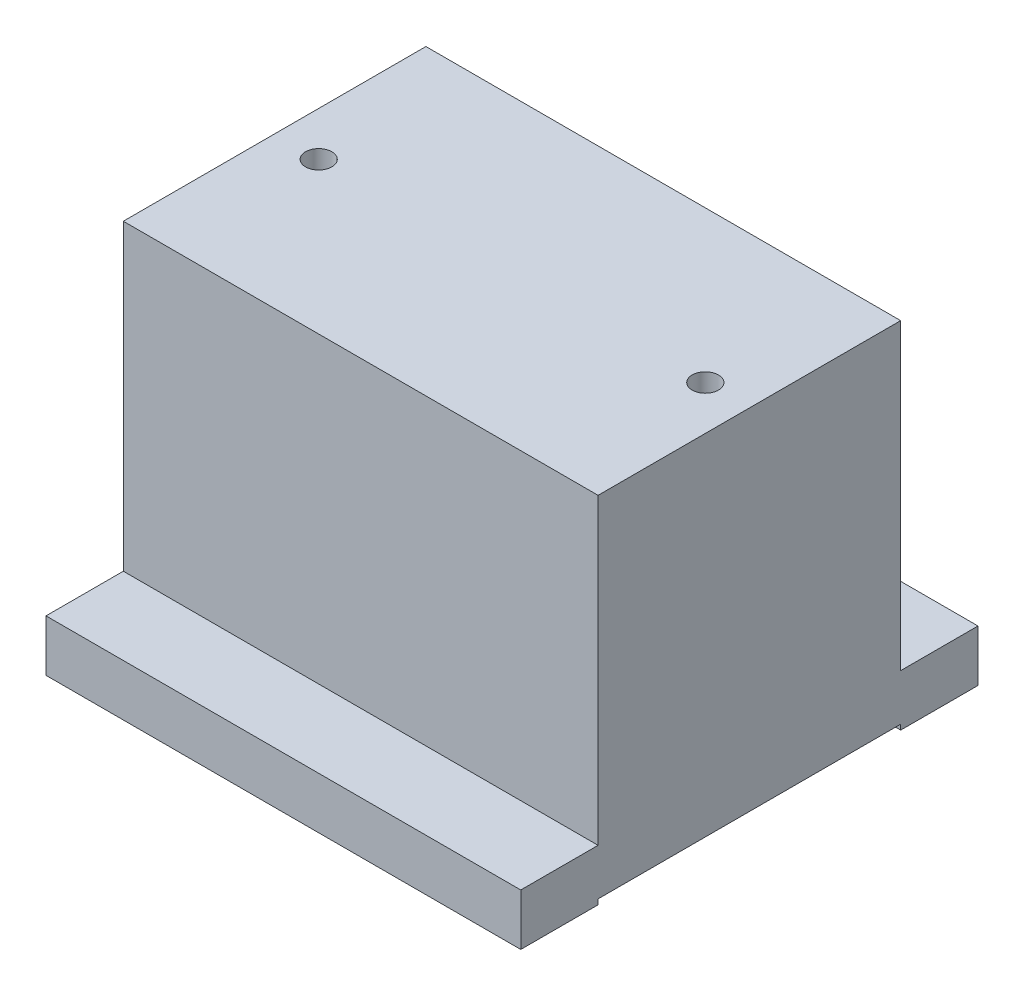
ISO-10303-21;
HEADER;
FILE_DESCRIPTION(('STEP AP214'),'2;1');
FILE_NAME('part.step','',(''),(''),'','','');
FILE_SCHEMA(('AUTOMOTIVE_DESIGN { 1 0 10303 214 1 1 1 1 }'));
ENDSEC;
DATA;
#1=APPLICATION_CONTEXT('core data for automotive mechanical design processes');
#2=APPLICATION_PROTOCOL_DEFINITION('international standard','automotive_design',2000,#1);
#3=PRODUCT_CONTEXT('',#1,'mechanical');
#4=PRODUCT('Part','Part','',(#3));
#5=PRODUCT_RELATED_PRODUCT_CATEGORY('part','',(#4));
#6=PRODUCT_DEFINITION_FORMATION('','',#4);
#7=PRODUCT_DEFINITION_CONTEXT('part definition',#1,'design');
#8=PRODUCT_DEFINITION('design','',#6,#7);
#9=PRODUCT_DEFINITION_SHAPE('','',#8);
#10=(LENGTH_UNIT() NAMED_UNIT(*) SI_UNIT(.MILLI.,.METRE.));
#11=(NAMED_UNIT(*) PLANE_ANGLE_UNIT() SI_UNIT($,.RADIAN.));
#12=(NAMED_UNIT(*) SI_UNIT($,.STERADIAN.) SOLID_ANGLE_UNIT());
#13=UNCERTAINTY_MEASURE_WITH_UNIT(LENGTH_MEASURE(1.E-05),#10,'distance_accuracy_value','');
#14=(GEOMETRIC_REPRESENTATION_CONTEXT(3) GLOBAL_UNCERTAINTY_ASSIGNED_CONTEXT((#13)) GLOBAL_UNIT_ASSIGNED_CONTEXT((#10,
#11,#12)) REPRESENTATION_CONTEXT('',''));
#15=CARTESIAN_POINT('',(0.,0.,0.));
#16=DIRECTION('',(0.,0.,1.));
#17=DIRECTION('',(1.,0.,0.));
#18=AXIS2_PLACEMENT_3D('',#15,#16,#17);
#19=CARTESIAN_POINT('',(46.05,0.,44.35));
#20=DIRECTION('',(0.,1.,0.));
#21=DIRECTION('',(0.,0.,1.));
#22=AXIS2_PLACEMENT_3D('',#19,#20,#21);
#23=PLANE('',#22);
#24=DIRECTION('',(0.,0.,-1.));
#25=VECTOR('',#24,1.);
#26=CARTESIAN_POINT('',(46.05,0.,-44.35));
#27=LINE('',#26,#25);
#28=CARTESIAN_POINT('',(46.05,0.,-29.35));
#29=VERTEX_POINT('',#28);
#30=CARTESIAN_POINT('',(46.05,0.,-44.35));
#31=VERTEX_POINT('',#30);
#32=EDGE_CURVE('E207',#29,#31,#27,.T.);
#33=ORIENTED_EDGE('',*,*,#32,.F.);
#34=DIRECTION('',(1.,0.,0.));
#35=VECTOR('',#34,1.);
#36=CARTESIAN_POINT('',(-46.05,0.,-29.35));
#37=LINE('',#36,#35);
#38=CARTESIAN_POINT('',(-46.05,0.,-29.35));
#39=VERTEX_POINT('',#38);
#40=EDGE_CURVE('E157',#39,#29,#37,.T.);
#41=ORIENTED_EDGE('',*,*,#40,.F.);
#42=DIRECTION('',(0.,0.,1.));
#43=VECTOR('',#42,1.);
#44=CARTESIAN_POINT('',(-46.05,0.,-44.35));
#45=LINE('',#44,#43);
#46=CARTESIAN_POINT('',(-46.05,0.,-44.35));
#47=VERTEX_POINT('',#46);
#48=EDGE_CURVE('E253',#47,#39,#45,.T.);
#49=ORIENTED_EDGE('',*,*,#48,.F.);
#50=DIRECTION('',(-1.,0.,0.));
#51=VECTOR('',#50,1.);
#52=CARTESIAN_POINT('',(-46.05,0.,-44.35));
#53=LINE('',#52,#51);
#54=EDGE_CURVE('E256',#31,#47,#53,.T.);
#55=ORIENTED_EDGE('',*,*,#54,.F.);
#56=EDGE_LOOP('',(#33,#41,#49,#55));
#57=FACE_BOUND('',#56,.T.);
#58=ADVANCED_FACE('F36',(#57),#23,.F.);
#59=CARTESIAN_POINT('',(46.05,10.,44.35));
#60=DIRECTION('',(0.,1.,0.));
#61=DIRECTION('',(0.,0.,1.));
#62=AXIS2_PLACEMENT_3D('',#59,#60,#61);
#63=PLANE('',#62);
#64=DIRECTION('',(1.,0.,0.));
#65=VECTOR('',#64,1.);
#66=CARTESIAN_POINT('',(-46.05,10.,29.35));
#67=LINE('',#66,#65);
#68=CARTESIAN_POINT('',(-46.05,10.,29.35));
#69=VERTEX_POINT('',#68);
#70=CARTESIAN_POINT('',(46.05,10.,29.35));
#71=VERTEX_POINT('',#70);
#72=EDGE_CURVE('E61',#69,#71,#67,.T.);
#73=ORIENTED_EDGE('',*,*,#72,.F.);
#74=DIRECTION('',(0.,0.,1.));
#75=VECTOR('',#74,1.);
#76=CARTESIAN_POINT('',(-46.05,10.,-44.35));
#77=LINE('',#76,#75);
#78=CARTESIAN_POINT('',(-46.05,10.,44.35));
#79=VERTEX_POINT('',#78);
#80=EDGE_CURVE('E195',#69,#79,#77,.T.);
#81=ORIENTED_EDGE('',*,*,#80,.T.);
#82=DIRECTION('',(1.,0.,0.));
#83=VECTOR('',#82,1.);
#84=CARTESIAN_POINT('',(-46.05,10.,44.35));
#85=LINE('',#84,#83);
#86=CARTESIAN_POINT('',(46.05,10.,44.35));
#87=VERTEX_POINT('',#86);
#88=EDGE_CURVE('E230',#79,#87,#85,.T.);
#89=ORIENTED_EDGE('',*,*,#88,.T.);
#90=DIRECTION('',(0.,0.,-1.));
#91=VECTOR('',#90,1.);
#92=CARTESIAN_POINT('',(46.05,10.,-44.35));
#93=LINE('',#92,#91);
#94=EDGE_CURVE('E231',#87,#71,#93,.T.);
#95=ORIENTED_EDGE('',*,*,#94,.T.);
#96=EDGE_LOOP('',(#73,#81,#89,#95));
#97=FACE_BOUND('',#96,.T.);
#98=ADVANCED_FACE('F297',(#97),#63,.T.);
#99=CARTESIAN_POINT('',(46.05,10.,-44.35));
#100=DIRECTION('',(-1.,0.,0.));
#101=DIRECTION('',(0.,0.,1.));
#102=AXIS2_PLACEMENT_3D('',#99,#100,#101);
#103=PLANE('',#102);
#104=DIRECTION('',(0.,0.,1.));
#105=VECTOR('',#104,1.);
#106=CARTESIAN_POINT('',(46.05,1.,29.35));
#107=LINE('',#106,#105);
#108=CARTESIAN_POINT('',(46.05,1.,-29.35));
#109=VERTEX_POINT('',#108);
#110=CARTESIAN_POINT('',(46.05,1.,29.35));
#111=VERTEX_POINT('',#110);
#112=EDGE_CURVE('E153',#109,#111,#107,.T.);
#113=ORIENTED_EDGE('',*,*,#112,.F.);
#114=DIRECTION('',(0.,-1.,0.));
#115=VECTOR('',#114,1.);
#116=CARTESIAN_POINT('',(46.05,1.,-29.35));
#117=LINE('',#116,#115);
#118=EDGE_CURVE('E167',#109,#29,#117,.T.);
#119=ORIENTED_EDGE('',*,*,#118,.T.);
#120=ORIENTED_EDGE('',*,*,#32,.T.);
#121=DIRECTION('',(0.,-1.,0.));
#122=VECTOR('',#121,1.);
#123=CARTESIAN_POINT('',(46.05,10.,-44.35));
#124=LINE('',#123,#122);
#125=CARTESIAN_POINT('',(46.05,10.,-44.35));
#126=VERTEX_POINT('',#125);
#127=EDGE_CURVE('E11',#126,#31,#124,.T.);
#128=ORIENTED_EDGE('',*,*,#127,.F.);
#129=CARTESIAN_POINT('',(46.05,10.,-29.35));
#130=VERTEX_POINT('',#129);
#131=EDGE_CURVE('E236',#130,#126,#93,.T.);
#132=ORIENTED_EDGE('',*,*,#131,.F.);
#133=DIRECTION('',(0.,-1.,0.));
#134=VECTOR('',#133,1.);
#135=CARTESIAN_POINT('',(46.05,68.8,-29.35));
#136=LINE('',#135,#134);
#137=CARTESIAN_POINT('',(46.05,68.8,-29.35));
#138=VERTEX_POINT('',#137);
#139=EDGE_CURVE('E201',#138,#130,#136,.T.);
#140=ORIENTED_EDGE('',*,*,#139,.F.);
#141=DIRECTION('',(0.,0.,-1.));
#142=VECTOR('',#141,1.);
#143=CARTESIAN_POINT('',(46.05,68.8,-29.35));
#144=LINE('',#143,#142);
#145=CARTESIAN_POINT('',(46.05,68.8,29.35));
#146=VERTEX_POINT('',#145);
#147=EDGE_CURVE('E177',#146,#138,#144,.T.);
#148=ORIENTED_EDGE('',*,*,#147,.F.);
#149=DIRECTION('',(0.,-1.,0.));
#150=VECTOR('',#149,1.);
#151=CARTESIAN_POINT('',(46.05,68.8,29.35));
#152=LINE('',#151,#150);
#153=EDGE_CURVE('E186',#146,#71,#152,.T.);
#154=ORIENTED_EDGE('',*,*,#153,.T.);
#155=ORIENTED_EDGE('',*,*,#94,.F.);
#156=DIRECTION('',(0.,-1.,0.));
#157=VECTOR('',#156,1.);
#158=CARTESIAN_POINT('',(46.05,10.,44.35));
#159=LINE('',#158,#157);
#160=CARTESIAN_POINT('',(46.05,0.,44.35));
#161=VERTEX_POINT('',#160);
#162=EDGE_CURVE('E249',#87,#161,#159,.T.);
#163=ORIENTED_EDGE('',*,*,#162,.T.);
#164=CARTESIAN_POINT('',(46.05,0.,29.35));
#165=VERTEX_POINT('',#164);
#166=EDGE_CURVE('E257',#161,#165,#27,.T.);
#167=ORIENTED_EDGE('',*,*,#166,.T.);
#168=DIRECTION('',(0.,-1.,0.));
#169=VECTOR('',#168,1.);
#170=CARTESIAN_POINT('',(46.05,1.,29.35));
#171=LINE('',#170,#169);
#172=EDGE_CURVE('E53',#111,#165,#171,.T.);
#173=ORIENTED_EDGE('',*,*,#172,.F.);
#174=EDGE_LOOP('',(#113,#119,#120,#128,#132,#140,#148,#154,#155,#163,#167,#173));
#175=FACE_BOUND('',#174,.T.);
#176=ADVANCED_FACE('F38',(#175),#103,.F.);
#177=CARTESIAN_POINT('',(-46.05,10.,-44.35));
#178=DIRECTION('',(0.,0.,1.));
#179=DIRECTION('',(1.,0.,0.));
#180=AXIS2_PLACEMENT_3D('',#177,#178,#179);
#181=PLANE('',#180);
#182=ORIENTED_EDGE('',*,*,#54,.T.);
#183=DIRECTION('',(0.,-1.,0.));
#184=VECTOR('',#183,1.);
#185=CARTESIAN_POINT('',(-46.05,10.,-44.35));
#186=LINE('',#185,#184);
#187=CARTESIAN_POINT('',(-46.05,10.,-44.35));
#188=VERTEX_POINT('',#187);
#189=EDGE_CURVE('E45',#188,#47,#186,.T.);
#190=ORIENTED_EDGE('',*,*,#189,.F.);
#191=DIRECTION('',(-1.,0.,0.));
#192=VECTOR('',#191,1.);
#193=CARTESIAN_POINT('',(-46.05,10.,-44.35));
#194=LINE('',#193,#192);
#195=EDGE_CURVE('E229',#126,#188,#194,.T.);
#196=ORIENTED_EDGE('',*,*,#195,.F.);
#197=ORIENTED_EDGE('',*,*,#127,.T.);
#198=EDGE_LOOP('',(#182,#190,#196,#197));
#199=FACE_BOUND('',#198,.T.);
#200=ADVANCED_FACE('F270',(#199),#181,.F.);
#201=CARTESIAN_POINT('',(-46.05,10.,-44.35));
#202=DIRECTION('',(1.,0.,0.));
#203=DIRECTION('',(0.,0.,-1.));
#204=AXIS2_PLACEMENT_3D('',#201,#202,#203);
#205=PLANE('',#204);
#206=ORIENTED_EDGE('',*,*,#48,.T.);
#207=DIRECTION('',(0.,-1.,0.));
#208=VECTOR('',#207,1.);
#209=CARTESIAN_POINT('',(-46.05,1.,-29.35));
#210=LINE('',#209,#208);
#211=CARTESIAN_POINT('',(-46.05,1.,-29.35));
#212=VERTEX_POINT('',#211);
#213=EDGE_CURVE('E171',#212,#39,#210,.T.);
#214=ORIENTED_EDGE('',*,*,#213,.F.);
#215=DIRECTION('',(0.,0.,-1.));
#216=VECTOR('',#215,1.);
#217=CARTESIAN_POINT('',(-46.05,1.,29.35));
#218=LINE('',#217,#216);
#219=CARTESIAN_POINT('',(-46.05,1.,29.35));
#220=VERTEX_POINT('',#219);
#221=EDGE_CURVE('E160',#220,#212,#218,.T.);
#222=ORIENTED_EDGE('',*,*,#221,.F.);
#223=DIRECTION('',(0.,-1.,0.));
#224=VECTOR('',#223,1.);
#225=CARTESIAN_POINT('',(-46.05,1.,29.35));
#226=LINE('',#225,#224);
#227=CARTESIAN_POINT('',(-46.05,0.,29.35));
#228=VERTEX_POINT('',#227);
#229=EDGE_CURVE('E173',#220,#228,#226,.T.);
#230=ORIENTED_EDGE('',*,*,#229,.T.);
#231=CARTESIAN_POINT('',(-46.05,0.,44.35));
#232=VERTEX_POINT('',#231);
#233=EDGE_CURVE('E255',#228,#232,#45,.T.);
#234=ORIENTED_EDGE('',*,*,#233,.T.);
#235=DIRECTION('',(0.,-1.,0.));
#236=VECTOR('',#235,1.);
#237=CARTESIAN_POINT('',(-46.05,10.,44.35));
#238=LINE('',#237,#236);
#239=EDGE_CURVE('E226',#79,#232,#238,.T.);
#240=ORIENTED_EDGE('',*,*,#239,.F.);
#241=ORIENTED_EDGE('',*,*,#80,.F.);
#242=DIRECTION('',(0.,-1.,0.));
#243=VECTOR('',#242,1.);
#244=CARTESIAN_POINT('',(-46.05,68.8,29.35));
#245=LINE('',#244,#243);
#246=CARTESIAN_POINT('',(-46.05,68.8,29.35));
#247=VERTEX_POINT('',#246);
#248=EDGE_CURVE('E202',#247,#69,#245,.T.);
#249=ORIENTED_EDGE('',*,*,#248,.F.);
#250=DIRECTION('',(0.,0.,1.));
#251=VECTOR('',#250,1.);
#252=CARTESIAN_POINT('',(-46.05,68.8,-29.35));
#253=LINE('',#252,#251);
#254=CARTESIAN_POINT('',(-46.05,68.8,-29.35));
#255=VERTEX_POINT('',#254);
#256=EDGE_CURVE('E182',#255,#247,#253,.T.);
#257=ORIENTED_EDGE('',*,*,#256,.F.);
#258=DIRECTION('',(0.,-1.,0.));
#259=VECTOR('',#258,1.);
#260=CARTESIAN_POINT('',(-46.05,68.8,-29.35));
#261=LINE('',#260,#259);
#262=CARTESIAN_POINT('',(-46.05,10.,-29.35));
#263=VERTEX_POINT('',#262);
#264=EDGE_CURVE('E198',#255,#263,#261,.T.);
#265=ORIENTED_EDGE('',*,*,#264,.T.);
#266=EDGE_CURVE('E228',#188,#263,#77,.T.);
#267=ORIENTED_EDGE('',*,*,#266,.F.);
#268=ORIENTED_EDGE('',*,*,#189,.T.);
#269=EDGE_LOOP('',(#206,#214,#222,#230,#234,#240,#241,#249,#257,#265,#267,#268));
#270=FACE_BOUND('',#269,.T.);
#271=ADVANCED_FACE('F223',(#270),#205,.F.);
#272=CARTESIAN_POINT('',(-46.05,10.,44.35));
#273=DIRECTION('',(0.,0.,-1.));
#274=DIRECTION('',(-1.,0.,0.));
#275=AXIS2_PLACEMENT_3D('',#272,#273,#274);
#276=PLANE('',#275);
#277=DIRECTION('',(1.,0.,0.));
#278=VECTOR('',#277,1.);
#279=CARTESIAN_POINT('',(-46.05,0.,44.35));
#280=LINE('',#279,#278);
#281=EDGE_CURVE('E244',#232,#161,#280,.T.);
#282=ORIENTED_EDGE('',*,*,#281,.T.);
#283=ORIENTED_EDGE('',*,*,#162,.F.);
#284=ORIENTED_EDGE('',*,*,#88,.F.);
#285=ORIENTED_EDGE('',*,*,#239,.T.);
#286=EDGE_LOOP('',(#282,#283,#284,#285));
#287=FACE_BOUND('',#286,.T.);
#288=ADVANCED_FACE('F312',(#287),#276,.F.);
#289=DIRECTION('',(-1.,0.,0.));
#290=VECTOR('',#289,1.);
#291=CARTESIAN_POINT('',(-46.05,10.,-29.35));
#292=LINE('',#291,#290);
#293=EDGE_CURVE('E170',#130,#263,#292,.T.);
#294=ORIENTED_EDGE('',*,*,#293,.F.);
#295=ORIENTED_EDGE('',*,*,#131,.T.);
#296=ORIENTED_EDGE('',*,*,#195,.T.);
#297=ORIENTED_EDGE('',*,*,#266,.T.);
#298=EDGE_LOOP('',(#294,#295,#296,#297));
#299=FACE_BOUND('',#298,.T.);
#300=ADVANCED_FACE('F273',(#299),#63,.T.);
#301=ORIENTED_EDGE('',*,*,#233,.F.);
#302=DIRECTION('',(-1.,0.,0.));
#303=VECTOR('',#302,1.);
#304=CARTESIAN_POINT('',(-46.05,0.,29.35));
#305=LINE('',#304,#303);
#306=EDGE_CURVE('E152',#165,#228,#305,.T.);
#307=ORIENTED_EDGE('',*,*,#306,.F.);
#308=ORIENTED_EDGE('',*,*,#166,.F.);
#309=ORIENTED_EDGE('',*,*,#281,.F.);
#310=EDGE_LOOP('',(#301,#307,#308,#309));
#311=FACE_BOUND('',#310,.T.);
#312=ADVANCED_FACE('F299',(#311),#23,.F.);
#313=CARTESIAN_POINT('',(-46.05,68.8,-29.35));
#314=DIRECTION('',(0.,0.,1.));
#315=DIRECTION('',(1.,0.,0.));
#316=AXIS2_PLACEMENT_3D('',#313,#314,#315);
#317=PLANE('',#316);
#318=ORIENTED_EDGE('',*,*,#293,.T.);
#319=ORIENTED_EDGE('',*,*,#264,.F.);
#320=DIRECTION('',(-1.,0.,0.));
#321=VECTOR('',#320,1.);
#322=CARTESIAN_POINT('',(-46.05,68.8,-29.35));
#323=LINE('',#322,#321);
#324=EDGE_CURVE('E180',#138,#255,#323,.T.);
#325=ORIENTED_EDGE('',*,*,#324,.F.);
#326=ORIENTED_EDGE('',*,*,#139,.T.);
#327=EDGE_LOOP('',(#318,#319,#325,#326));
#328=FACE_BOUND('',#327,.T.);
#329=ADVANCED_FACE('F275',(#328),#317,.F.);
#330=CARTESIAN_POINT('',(-46.05,68.8,29.35));
#331=DIRECTION('',(0.,0.,-1.));
#332=DIRECTION('',(-1.,0.,0.));
#333=AXIS2_PLACEMENT_3D('',#330,#331,#332);
#334=PLANE('',#333);
#335=ORIENTED_EDGE('',*,*,#72,.T.);
#336=ORIENTED_EDGE('',*,*,#153,.F.);
#337=DIRECTION('',(1.,0.,0.));
#338=VECTOR('',#337,1.);
#339=CARTESIAN_POINT('',(-46.05,68.8,29.35));
#340=LINE('',#339,#338);
#341=EDGE_CURVE('E184',#247,#146,#340,.T.);
#342=ORIENTED_EDGE('',*,*,#341,.F.);
#343=ORIENTED_EDGE('',*,*,#248,.T.);
#344=EDGE_LOOP('',(#335,#336,#342,#343));
#345=FACE_BOUND('',#344,.T.);
#346=ADVANCED_FACE('F218',(#345),#334,.F.);
#347=CARTESIAN_POINT('',(46.05,68.8,29.35));
#348=DIRECTION('',(0.,1.,0.));
#349=DIRECTION('',(0.,0.,1.));
#350=AXIS2_PLACEMENT_3D('',#347,#348,#349);
#351=PLANE('',#350);
#352=CARTESIAN_POINT('',(-37.5,68.8,0.));
#353=DIRECTION('',(0.,1.,0.));
#354=DIRECTION('',(0.,0.,1.));
#355=AXIS2_PLACEMENT_3D('',#352,#353,#354);
#356=CIRCLE('',#355,2.55269999999999);
#357=CARTESIAN_POINT('',(-37.5,68.8,2.55269999999999));
#358=VERTEX_POINT('',#357);
#359=EDGE_CURVE('E142',#358,#358,#356,.T.);
#360=ORIENTED_EDGE('',*,*,#359,.F.);
#361=EDGE_LOOP('',(#360));
#362=FACE_BOUND('',#361,.T.);
#363=CARTESIAN_POINT('',(37.5,68.8,0.));
#364=DIRECTION('',(0.,1.,0.));
#365=DIRECTION('',(0.,0.,1.));
#366=AXIS2_PLACEMENT_3D('',#363,#364,#365);
#367=CIRCLE('',#366,2.55269999999999);
#368=CARTESIAN_POINT('',(37.5,68.8,2.55269999999999));
#369=VERTEX_POINT('',#368);
#370=EDGE_CURVE('E141',#369,#369,#367,.T.);
#371=ORIENTED_EDGE('',*,*,#370,.F.);
#372=EDGE_LOOP('',(#371));
#373=FACE_BOUND('',#372,.T.);
#374=ORIENTED_EDGE('',*,*,#147,.T.);
#375=ORIENTED_EDGE('',*,*,#324,.T.);
#376=ORIENTED_EDGE('',*,*,#256,.T.);
#377=ORIENTED_EDGE('',*,*,#341,.T.);
#378=EDGE_LOOP('',(#374,#375,#376,#377));
#379=FACE_BOUND('',#378,.T.);
#380=ADVANCED_FACE('F280',(#362,#373,#379),#351,.T.);
#381=CARTESIAN_POINT('',(-46.05,1.,-29.35));
#382=DIRECTION('',(0.,0.,-1.));
#383=DIRECTION('',(-1.,0.,0.));
#384=AXIS2_PLACEMENT_3D('',#381,#382,#383);
#385=PLANE('',#384);
#386=ORIENTED_EDGE('',*,*,#40,.T.);
#387=ORIENTED_EDGE('',*,*,#118,.F.);
#388=DIRECTION('',(1.,0.,0.));
#389=VECTOR('',#388,1.);
#390=CARTESIAN_POINT('',(-46.05,1.,-29.35));
#391=LINE('',#390,#389);
#392=EDGE_CURVE('E162',#212,#109,#391,.T.);
#393=ORIENTED_EDGE('',*,*,#392,.F.);
#394=ORIENTED_EDGE('',*,*,#213,.T.);
#395=EDGE_LOOP('',(#386,#387,#393,#394));
#396=FACE_BOUND('',#395,.T.);
#397=ADVANCED_FACE('F282',(#396),#385,.F.);
#398=CARTESIAN_POINT('',(-46.05,1.,29.35));
#399=DIRECTION('',(0.,0.,1.));
#400=DIRECTION('',(1.,0.,0.));
#401=AXIS2_PLACEMENT_3D('',#398,#399,#400);
#402=PLANE('',#401);
#403=ORIENTED_EDGE('',*,*,#306,.T.);
#404=ORIENTED_EDGE('',*,*,#229,.F.);
#405=DIRECTION('',(-1.,0.,0.));
#406=VECTOR('',#405,1.);
#407=CARTESIAN_POINT('',(-46.05,1.,29.35));
#408=LINE('',#407,#406);
#409=EDGE_CURVE('E156',#111,#220,#408,.T.);
#410=ORIENTED_EDGE('',*,*,#409,.F.);
#411=ORIENTED_EDGE('',*,*,#172,.T.);
#412=EDGE_LOOP('',(#403,#404,#410,#411));
#413=FACE_BOUND('',#412,.T.);
#414=ADVANCED_FACE('F289',(#413),#402,.F.);
#415=CARTESIAN_POINT('',(46.05,1.,-29.35));
#416=DIRECTION('',(0.,-1.,0.));
#417=DIRECTION('',(0.,0.,-1.));
#418=AXIS2_PLACEMENT_3D('',#415,#416,#417);
#419=PLANE('',#418);
#420=ORIENTED_EDGE('',*,*,#112,.T.);
#421=ORIENTED_EDGE('',*,*,#409,.T.);
#422=ORIENTED_EDGE('',*,*,#221,.T.);
#423=ORIENTED_EDGE('',*,*,#392,.T.);
#424=EDGE_LOOP('',(#420,#421,#422,#423));
#425=FACE_BOUND('',#424,.T.);
#426=ADVANCED_FACE('F378',(#425),#419,.T.);
#427=CARTESIAN_POINT('',(37.5,52.29,0.));
#428=DIRECTION('',(0.,1.,0.));
#429=DIRECTION('',(0.,0.,1.));
#430=AXIS2_PLACEMENT_3D('',#427,#428,#429);
#431=CONICAL_SURFACE('',#430,2.55269999999998,1.02974425867665);
#432=CARTESIAN_POINT('',(37.5,50.7561830978084,0.));
#433=VERTEX_POINT('',#432);
#434=VERTEX_LOOP('',#433);
#435=FACE_BOUND('',#434,.T.);
#436=CARTESIAN_POINT('',(37.5,52.29,0.));
#437=DIRECTION('',(0.,1.,0.));
#438=DIRECTION('',(0.,0.,1.));
#439=AXIS2_PLACEMENT_3D('',#436,#437,#438);
#440=CIRCLE('',#439,2.55269999999998);
#441=CARTESIAN_POINT('',(37.5,52.29,2.55269999999998));
#442=VERTEX_POINT('',#441);
#443=EDGE_CURVE('E145',#442,#442,#440,.T.);
#444=ORIENTED_EDGE('',*,*,#443,.T.);
#445=EDGE_LOOP('',(#444));
#446=FACE_BOUND('',#445,.T.);
#447=ADVANCED_FACE('F385',(#435,#446),#431,.F.);
#448=CARTESIAN_POINT('',(37.5,68.8,0.));
#449=DIRECTION('',(0.,1.,0.));
#450=DIRECTION('',(0.,0.,1.));
#451=AXIS2_PLACEMENT_3D('',#448,#449,#450);
#452=CYLINDRICAL_SURFACE('',#451,2.55269999999999);
#453=ORIENTED_EDGE('',*,*,#443,.F.);
#454=EDGE_LOOP('',(#453));
#455=FACE_BOUND('',#454,.T.);
#456=ORIENTED_EDGE('',*,*,#370,.T.);
#457=EDGE_LOOP('',(#456));
#458=FACE_BOUND('',#457,.T.);
#459=ADVANCED_FACE('F135',(#455,#458),#452,.F.);
#460=CARTESIAN_POINT('',(-37.5,52.29,0.));
#461=DIRECTION('',(0.,1.,0.));
#462=DIRECTION('',(0.,0.,1.));
#463=AXIS2_PLACEMENT_3D('',#460,#461,#462);
#464=CONICAL_SURFACE('',#463,2.55269999999998,1.02974425867665);
#465=CARTESIAN_POINT('',(-37.5,50.7561830978084,0.));
#466=VERTEX_POINT('',#465);
#467=VERTEX_LOOP('',#466);
#468=FACE_BOUND('',#467,.T.);
#469=CARTESIAN_POINT('',(-37.5,52.29,0.));
#470=DIRECTION('',(0.,1.,0.));
#471=DIRECTION('',(0.,0.,1.));
#472=AXIS2_PLACEMENT_3D('',#469,#470,#471);
#473=CIRCLE('',#472,2.55269999999998);
#474=CARTESIAN_POINT('',(-37.5,52.29,2.55269999999998));
#475=VERTEX_POINT('',#474);
#476=EDGE_CURVE('E139',#475,#475,#473,.T.);
#477=ORIENTED_EDGE('',*,*,#476,.T.);
#478=EDGE_LOOP('',(#477));
#479=FACE_BOUND('',#478,.T.);
#480=ADVANCED_FACE('F131',(#468,#479),#464,.F.);
#481=CARTESIAN_POINT('',(-37.5,68.8,0.));
#482=DIRECTION('',(0.,1.,0.));
#483=DIRECTION('',(0.,0.,1.));
#484=AXIS2_PLACEMENT_3D('',#481,#482,#483);
#485=CYLINDRICAL_SURFACE('',#484,2.55269999999999);
#486=ORIENTED_EDGE('',*,*,#476,.F.);
#487=EDGE_LOOP('',(#486));
#488=FACE_BOUND('',#487,.T.);
#489=ORIENTED_EDGE('',*,*,#359,.T.);
#490=EDGE_LOOP('',(#489));
#491=FACE_BOUND('',#490,.T.);
#492=ADVANCED_FACE('F134',(#488,#491),#485,.F.);
#493=CLOSED_SHELL('',(#58,#98,#176,#200,#271,#288,#300,#312,#329,#346,#380,#397,#414,#426,#447,
#459,#480,#492));
#494=MANIFOLD_SOLID_BREP('B2',#493);
#495=ADVANCED_BREP_SHAPE_REPRESENTATION('',(#18,#494),#14);
#496=SHAPE_DEFINITION_REPRESENTATION(#9,#495);
ENDSEC;
END-ISO-10303-21;
